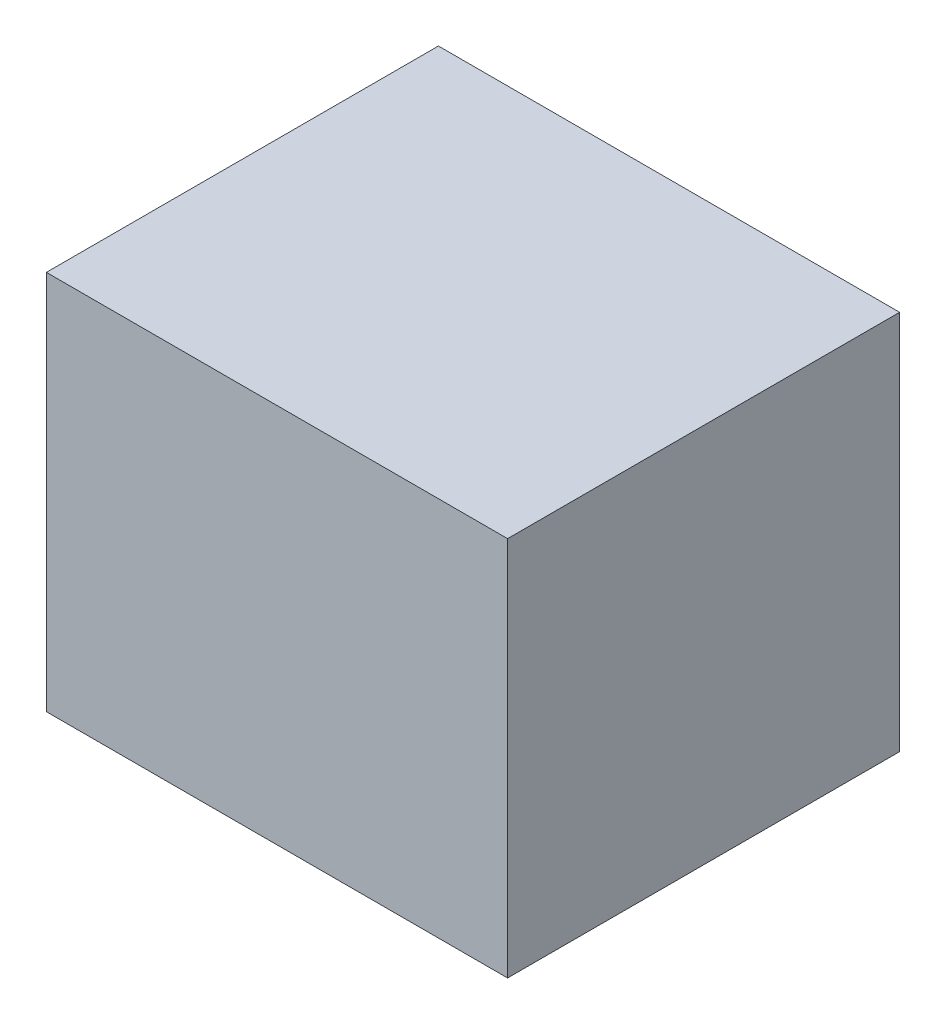
ISO-10303-21;
HEADER;
FILE_DESCRIPTION(('STEP AP214'),'2;1');
FILE_NAME('part.step','',(''),(''),'','','');
FILE_SCHEMA(('AUTOMOTIVE_DESIGN { 1 0 10303 214 1 1 1 1 }'));
ENDSEC;
DATA;
#1=APPLICATION_CONTEXT('core data for automotive mechanical design processes');
#2=APPLICATION_PROTOCOL_DEFINITION('international standard','automotive_design',2000,#1);
#3=PRODUCT_CONTEXT('',#1,'mechanical');
#4=PRODUCT('Part','Part','',(#3));
#5=PRODUCT_RELATED_PRODUCT_CATEGORY('part','',(#4));
#6=PRODUCT_DEFINITION_FORMATION('','',#4);
#7=PRODUCT_DEFINITION_CONTEXT('part definition',#1,'design');
#8=PRODUCT_DEFINITION('design','',#6,#7);
#9=PRODUCT_DEFINITION_SHAPE('','',#8);
#10=(LENGTH_UNIT() NAMED_UNIT(*) SI_UNIT(.MILLI.,.METRE.));
#11=(NAMED_UNIT(*) PLANE_ANGLE_UNIT() SI_UNIT($,.RADIAN.));
#12=(NAMED_UNIT(*) SI_UNIT($,.STERADIAN.) SOLID_ANGLE_UNIT());
#13=UNCERTAINTY_MEASURE_WITH_UNIT(LENGTH_MEASURE(1.E-05),#10,'distance_accuracy_value','');
#14=(GEOMETRIC_REPRESENTATION_CONTEXT(3) GLOBAL_UNCERTAINTY_ASSIGNED_CONTEXT((#13)) GLOBAL_UNIT_ASSIGNED_CONTEXT((#10,
#11,#12)) REPRESENTATION_CONTEXT('',''));
#15=CARTESIAN_POINT('',(0.,0.,0.));
#16=DIRECTION('',(0.,0.,1.));
#17=DIRECTION('',(1.,0.,0.));
#18=AXIS2_PLACEMENT_3D('',#15,#16,#17);
#19=CARTESIAN_POINT('',(-86.900431455746,60.2197802197802,170.));
#20=DIRECTION('',(1.,0.,0.));
#21=DIRECTION('',(0.,1.,0.));
#22=AXIS2_PLACEMENT_3D('',#19,#20,#21);
#23=PLANE('',#22);
#24=DIRECTION('',(0.,-1.,0.));
#25=VECTOR('',#24,1.);
#26=CARTESIAN_POINT('',(-86.900431455746,60.2197802197802,0.));
#27=LINE('',#26,#25);
#28=CARTESIAN_POINT('',(-86.900431455746,60.2197802197802,0.));
#29=VERTEX_POINT('',#28);
#30=CARTESIAN_POINT('',(-86.900431455746,-104.78021978022,0.));
#31=VERTEX_POINT('',#30);
#32=EDGE_CURVE('E107',#29,#31,#27,.T.);
#33=ORIENTED_EDGE('',*,*,#32,.T.);
#34=DIRECTION('',(0.,0.,-1.));
#35=VECTOR('',#34,1.);
#36=CARTESIAN_POINT('',(-86.900431455746,-104.78021978022,170.));
#37=LINE('',#36,#35);
#38=CARTESIAN_POINT('',(-86.900431455746,-104.78021978022,170.));
#39=VERTEX_POINT('',#38);
#40=EDGE_CURVE('E11',#39,#31,#37,.T.);
#41=ORIENTED_EDGE('',*,*,#40,.F.);
#42=DIRECTION('',(0.,-1.,0.));
#43=VECTOR('',#42,1.);
#44=CARTESIAN_POINT('',(-86.900431455746,60.2197802197802,170.));
#45=LINE('',#44,#43);
#46=CARTESIAN_POINT('',(-86.900431455746,60.2197802197802,170.));
#47=VERTEX_POINT('',#46);
#48=EDGE_CURVE('E91',#47,#39,#45,.T.);
#49=ORIENTED_EDGE('',*,*,#48,.F.);
#50=DIRECTION('',(0.,0.,-1.));
#51=VECTOR('',#50,1.);
#52=CARTESIAN_POINT('',(-86.900431455746,60.2197802197802,170.));
#53=LINE('',#52,#51);
#54=EDGE_CURVE('E103',#47,#29,#53,.T.);
#55=ORIENTED_EDGE('',*,*,#54,.T.);
#56=EDGE_LOOP('',(#33,#41,#49,#55));
#57=FACE_BOUND('',#56,.T.);
#58=ADVANCED_FACE('F39',(#57),#23,.F.);
#59=CARTESIAN_POINT('',(-86.900431455746,-104.78021978022,170.));
#60=DIRECTION('',(0.,1.,0.));
#61=DIRECTION('',(0.,0.,1.));
#62=AXIS2_PLACEMENT_3D('',#59,#60,#61);
#63=PLANE('',#62);
#64=DIRECTION('',(1.,0.,0.));
#65=VECTOR('',#64,1.);
#66=CARTESIAN_POINT('',(-86.900431455746,-104.78021978022,0.));
#67=LINE('',#66,#65);
#68=CARTESIAN_POINT('',(113.099568544254,-104.78021978022,0.));
#69=VERTEX_POINT('',#68);
#70=EDGE_CURVE('E96',#31,#69,#67,.T.);
#71=ORIENTED_EDGE('',*,*,#70,.T.);
#72=DIRECTION('',(0.,0.,-1.));
#73=VECTOR('',#72,1.);
#74=CARTESIAN_POINT('',(113.099568544254,-104.78021978022,170.));
#75=LINE('',#74,#73);
#76=CARTESIAN_POINT('',(113.099568544254,-104.78021978022,170.));
#77=VERTEX_POINT('',#76);
#78=EDGE_CURVE('E48',#77,#69,#75,.T.);
#79=ORIENTED_EDGE('',*,*,#78,.F.);
#80=DIRECTION('',(1.,0.,0.));
#81=VECTOR('',#80,1.);
#82=CARTESIAN_POINT('',(-86.900431455746,-104.78021978022,170.));
#83=LINE('',#82,#81);
#84=EDGE_CURVE('E86',#39,#77,#83,.T.);
#85=ORIENTED_EDGE('',*,*,#84,.F.);
#86=ORIENTED_EDGE('',*,*,#40,.T.);
#87=EDGE_LOOP('',(#71,#79,#85,#86));
#88=FACE_BOUND('',#87,.T.);
#89=ADVANCED_FACE('F95',(#88),#63,.F.);
#90=CARTESIAN_POINT('',(113.099568544254,60.2197802197802,170.));
#91=DIRECTION('',(-1.,0.,0.));
#92=DIRECTION('',(0.,-1.,0.));
#93=AXIS2_PLACEMENT_3D('',#90,#91,#92);
#94=PLANE('',#93);
#95=DIRECTION('',(0.,1.,0.));
#96=VECTOR('',#95,1.);
#97=CARTESIAN_POINT('',(113.099568544254,60.2197802197802,0.));
#98=LINE('',#97,#96);
#99=CARTESIAN_POINT('',(113.099568544254,60.2197802197802,0.));
#100=VERTEX_POINT('',#99);
#101=EDGE_CURVE('E73',#69,#100,#98,.T.);
#102=ORIENTED_EDGE('',*,*,#101,.T.);
#103=DIRECTION('',(0.,0.,-1.));
#104=VECTOR('',#103,1.);
#105=CARTESIAN_POINT('',(113.099568544254,60.2197802197802,170.));
#106=LINE('',#105,#104);
#107=CARTESIAN_POINT('',(113.099568544254,60.2197802197802,170.));
#108=VERTEX_POINT('',#107);
#109=EDGE_CURVE('E98',#108,#100,#106,.T.);
#110=ORIENTED_EDGE('',*,*,#109,.F.);
#111=DIRECTION('',(0.,1.,0.));
#112=VECTOR('',#111,1.);
#113=CARTESIAN_POINT('',(113.099568544254,60.2197802197802,170.));
#114=LINE('',#113,#112);
#115=EDGE_CURVE('E89',#77,#108,#114,.T.);
#116=ORIENTED_EDGE('',*,*,#115,.F.);
#117=ORIENTED_EDGE('',*,*,#78,.T.);
#118=EDGE_LOOP('',(#102,#110,#116,#117));
#119=FACE_BOUND('',#118,.T.);
#120=ADVANCED_FACE('F99',(#119),#94,.F.);
#121=CARTESIAN_POINT('',(-86.900431455746,60.2197802197802,170.));
#122=DIRECTION('',(0.,-1.,0.));
#123=DIRECTION('',(0.,0.,-1.));
#124=AXIS2_PLACEMENT_3D('',#121,#122,#123);
#125=PLANE('',#124);
#126=DIRECTION('',(-1.,0.,0.));
#127=VECTOR('',#126,1.);
#128=CARTESIAN_POINT('',(-86.900431455746,60.2197802197802,0.));
#129=LINE('',#128,#127);
#130=EDGE_CURVE('E79',#100,#29,#129,.T.);
#131=ORIENTED_EDGE('',*,*,#130,.T.);
#132=ORIENTED_EDGE('',*,*,#54,.F.);
#133=DIRECTION('',(-1.,0.,0.));
#134=VECTOR('',#133,1.);
#135=CARTESIAN_POINT('',(-86.900431455746,60.2197802197802,170.));
#136=LINE('',#135,#134);
#137=EDGE_CURVE('E56',#108,#47,#136,.T.);
#138=ORIENTED_EDGE('',*,*,#137,.F.);
#139=ORIENTED_EDGE('',*,*,#109,.T.);
#140=EDGE_LOOP('',(#131,#132,#138,#139));
#141=FACE_BOUND('',#140,.T.);
#142=ADVANCED_FACE('F120',(#141),#125,.F.);
#143=CARTESIAN_POINT('',(0.,0.,170.));
#144=DIRECTION('',(0.,0.,1.));
#145=DIRECTION('',(1.,0.,0.));
#146=AXIS2_PLACEMENT_3D('',#143,#144,#145);
#147=PLANE('',#146);
#148=ORIENTED_EDGE('',*,*,#48,.T.);
#149=ORIENTED_EDGE('',*,*,#84,.T.);
#150=ORIENTED_EDGE('',*,*,#115,.T.);
#151=ORIENTED_EDGE('',*,*,#137,.T.);
#152=EDGE_LOOP('',(#148,#149,#150,#151));
#153=FACE_BOUND('',#152,.T.);
#154=ADVANCED_FACE('F87',(#153),#147,.T.);
#155=CARTESIAN_POINT('',(0.,0.,0.));
#156=DIRECTION('',(0.,0.,1.));
#157=DIRECTION('',(1.,0.,0.));
#158=AXIS2_PLACEMENT_3D('',#155,#156,#157);
#159=PLANE('',#158);
#160=ORIENTED_EDGE('',*,*,#32,.F.);
#161=ORIENTED_EDGE('',*,*,#130,.F.);
#162=ORIENTED_EDGE('',*,*,#101,.F.);
#163=ORIENTED_EDGE('',*,*,#70,.F.);
#164=EDGE_LOOP('',(#160,#161,#162,#163));
#165=FACE_BOUND('',#164,.T.);
#166=ADVANCED_FACE('F123',(#165),#159,.F.);
#167=CLOSED_SHELL('',(#58,#89,#120,#142,#154,#166));
#168=MANIFOLD_SOLID_BREP('B2',#167);
#169=ADVANCED_BREP_SHAPE_REPRESENTATION('',(#18,#168),#14);
#170=SHAPE_DEFINITION_REPRESENTATION(#9,#169);
ENDSEC;
END-ISO-10303-21;
